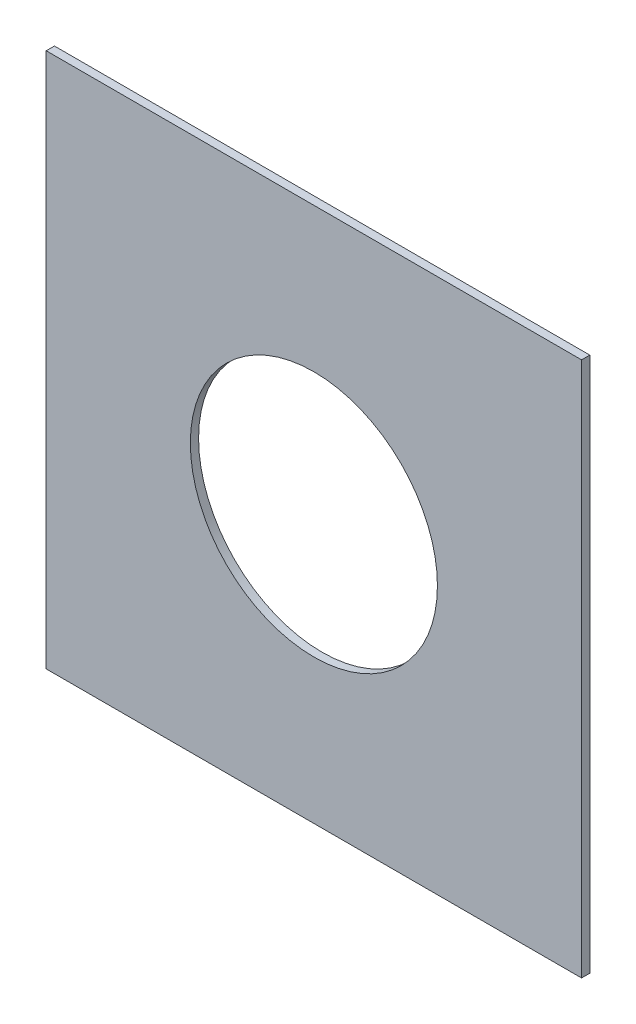
ISO-10303-21;
HEADER;
FILE_DESCRIPTION(('STEP AP214'),'2;1');
FILE_NAME('part.step','',(''),(''),'','','');
FILE_SCHEMA(('AUTOMOTIVE_DESIGN { 1 0 10303 214 1 1 1 1 }'));
ENDSEC;
DATA;
#1=APPLICATION_CONTEXT('core data for automotive mechanical design processes');
#2=APPLICATION_PROTOCOL_DEFINITION('international standard','automotive_design',2000,#1);
#3=PRODUCT_CONTEXT('',#1,'mechanical');
#4=PRODUCT('Part','Part','',(#3));
#5=PRODUCT_RELATED_PRODUCT_CATEGORY('part','',(#4));
#6=PRODUCT_DEFINITION_FORMATION('','',#4);
#7=PRODUCT_DEFINITION_CONTEXT('part definition',#1,'design');
#8=PRODUCT_DEFINITION('design','',#6,#7);
#9=PRODUCT_DEFINITION_SHAPE('','',#8);
#10=(LENGTH_UNIT() NAMED_UNIT(*) SI_UNIT(.MILLI.,.METRE.));
#11=(NAMED_UNIT(*) PLANE_ANGLE_UNIT() SI_UNIT($,.RADIAN.));
#12=(NAMED_UNIT(*) SI_UNIT($,.STERADIAN.) SOLID_ANGLE_UNIT());
#13=UNCERTAINTY_MEASURE_WITH_UNIT(LENGTH_MEASURE(1.E-05),#10,'distance_accuracy_value','');
#14=(GEOMETRIC_REPRESENTATION_CONTEXT(3) GLOBAL_UNCERTAINTY_ASSIGNED_CONTEXT((#13)) GLOBAL_UNIT_ASSIGNED_CONTEXT((#10,
#11,#12)) REPRESENTATION_CONTEXT('',''));
#15=CARTESIAN_POINT('',(0.,0.,0.));
#16=DIRECTION('',(0.,0.,1.));
#17=DIRECTION('',(1.,0.,0.));
#18=AXIS2_PLACEMENT_3D('',#15,#16,#17);
#19=CARTESIAN_POINT('',(-4.326,-3.55,-6.999));
#20=DIRECTION('',(0.,1.,0.));
#21=DIRECTION('',(1.,0.,0.));
#22=AXIS2_PLACEMENT_3D('',#19,#20,#21);
#23=PLANE('',#22);
#24=DIRECTION('',(0.,0.,1.));
#25=VECTOR('',#24,1.);
#26=CARTESIAN_POINT('',(-3.025,-3.55,-7.01));
#27=LINE('',#26,#25);
#28=CARTESIAN_POINT('',(-3.025,-3.55,-7.02));
#29=VERTEX_POINT('',#28);
#30=CARTESIAN_POINT('',(-3.025,-3.55,-7.));
#31=VERTEX_POINT('',#30);
#32=EDGE_CURVE('E62',#29,#31,#27,.T.);
#33=ORIENTED_EDGE('',*,*,#32,.F.);
#34=DIRECTION('',(1.,0.,0.));
#35=VECTOR('',#34,1.);
#36=CARTESIAN_POINT('',(-3.675,-3.55,-7.02));
#37=LINE('',#36,#35);
#38=CARTESIAN_POINT('',(-4.325,-3.55,-7.02));
#39=VERTEX_POINT('',#38);
#40=EDGE_CURVE('E87',#39,#29,#37,.T.);
#41=ORIENTED_EDGE('',*,*,#40,.F.);
#42=DIRECTION('',(0.,0.,-1.));
#43=VECTOR('',#42,1.);
#44=CARTESIAN_POINT('',(-4.325,-3.55,-7.01));
#45=LINE('',#44,#43);
#46=CARTESIAN_POINT('',(-4.325,-3.55,-7.));
#47=VERTEX_POINT('',#46);
#48=EDGE_CURVE('E73',#47,#39,#45,.T.);
#49=ORIENTED_EDGE('',*,*,#48,.F.);
#50=DIRECTION('',(-1.,0.,0.));
#51=VECTOR('',#50,1.);
#52=CARTESIAN_POINT('',(-3.675,-3.55,-7.));
#53=LINE('',#52,#51);
#54=EDGE_CURVE('E56',#31,#47,#53,.T.);
#55=ORIENTED_EDGE('',*,*,#54,.F.);
#56=EDGE_LOOP('',(#33,#41,#49,#55));
#57=FACE_BOUND('',#56,.T.);
#58=ADVANCED_FACE('F17',(#57),#23,.T.);
#59=CARTESIAN_POINT('',(-3.025,-3.549,-6.999));
#60=DIRECTION('',(1.,0.,0.));
#61=DIRECTION('',(0.,-1.,0.));
#62=AXIS2_PLACEMENT_3D('',#59,#60,#61);
#63=PLANE('',#62);
#64=DIRECTION('',(0.,0.,-1.));
#65=VECTOR('',#64,1.);
#66=CARTESIAN_POINT('',(-3.025,-4.85,-7.01));
#67=LINE('',#66,#65);
#68=CARTESIAN_POINT('',(-3.025,-4.85,-7.));
#69=VERTEX_POINT('',#68);
#70=CARTESIAN_POINT('',(-3.025,-4.85,-7.02));
#71=VERTEX_POINT('',#70);
#72=EDGE_CURVE('E71',#69,#71,#67,.T.);
#73=ORIENTED_EDGE('',*,*,#72,.T.);
#74=DIRECTION('',(0.,-1.,0.));
#75=VECTOR('',#74,1.);
#76=CARTESIAN_POINT('',(-3.025,-4.2,-7.02));
#77=LINE('',#76,#75);
#78=EDGE_CURVE('E67',#29,#71,#77,.T.);
#79=ORIENTED_EDGE('',*,*,#78,.F.);
#80=ORIENTED_EDGE('',*,*,#32,.T.);
#81=DIRECTION('',(0.,1.,0.));
#82=VECTOR('',#81,1.);
#83=CARTESIAN_POINT('',(-3.025,-4.2,-7.));
#84=LINE('',#83,#82);
#85=EDGE_CURVE('E64',#69,#31,#84,.T.);
#86=ORIENTED_EDGE('',*,*,#85,.F.);
#87=EDGE_LOOP('',(#73,#79,#80,#86));
#88=FACE_BOUND('',#87,.T.);
#89=ADVANCED_FACE('F63',(#88),#63,.T.);
#90=CARTESIAN_POINT('',(-3.675,-4.2,-7.));
#91=DIRECTION('',(0.,0.,-1.));
#92=DIRECTION('',(-1.,0.,0.));
#93=AXIS2_PLACEMENT_3D('',#90,#91,#92);
#94=CYLINDRICAL_SURFACE('',#93,0.3);
#95=CARTESIAN_POINT('',(-3.675,-4.2,-7.02));
#96=DIRECTION('',(0.,0.,-1.));
#97=DIRECTION('',(-1.,0.,0.));
#98=AXIS2_PLACEMENT_3D('',#95,#96,#97);
#99=CIRCLE('',#98,0.3);
#100=CARTESIAN_POINT('',(-3.975,-4.2,-7.02));
#101=VERTEX_POINT('',#100);
#102=EDGE_CURVE('E82',#101,#101,#99,.F.);
#103=ORIENTED_EDGE('',*,*,#102,.F.);
#104=EDGE_LOOP('',(#103));
#105=FACE_BOUND('',#104,.T.);
#106=CARTESIAN_POINT('',(-3.675,-4.2,-7.));
#107=DIRECTION('',(0.,0.,-1.));
#108=DIRECTION('',(-1.,0.,0.));
#109=AXIS2_PLACEMENT_3D('',#106,#107,#108);
#110=CIRCLE('',#109,0.3);
#111=CARTESIAN_POINT('',(-3.975,-4.2,-7.));
#112=VERTEX_POINT('',#111);
#113=EDGE_CURVE('E21',#112,#112,#110,.T.);
#114=ORIENTED_EDGE('',*,*,#113,.F.);
#115=EDGE_LOOP('',(#114));
#116=FACE_BOUND('',#115,.T.);
#117=ADVANCED_FACE('F99',(#105,#116),#94,.F.);
#118=CARTESIAN_POINT('',(-3.024,-3.549,-7.));
#119=DIRECTION('',(0.,0.,1.));
#120=DIRECTION('',(-1.,0.,0.));
#121=AXIS2_PLACEMENT_3D('',#118,#119,#120);
#122=PLANE('',#121);
#123=ORIENTED_EDGE('',*,*,#113,.T.);
#124=EDGE_LOOP('',(#123));
#125=FACE_BOUND('',#124,.T.);
#126=DIRECTION('',(0.,1.,0.));
#127=VECTOR('',#126,1.);
#128=CARTESIAN_POINT('',(-4.325,-4.2,-7.));
#129=LINE('',#128,#127);
#130=CARTESIAN_POINT('',(-4.325,-4.85,-7.));
#131=VERTEX_POINT('',#130);
#132=EDGE_CURVE('E94',#131,#47,#129,.T.);
#133=ORIENTED_EDGE('',*,*,#132,.F.);
#134=DIRECTION('',(-1.,0.,0.));
#135=VECTOR('',#134,1.);
#136=CARTESIAN_POINT('',(-3.675,-4.85,-7.));
#137=LINE('',#136,#135);
#138=EDGE_CURVE('E78',#69,#131,#137,.T.);
#139=ORIENTED_EDGE('',*,*,#138,.F.);
#140=ORIENTED_EDGE('',*,*,#85,.T.);
#141=ORIENTED_EDGE('',*,*,#54,.T.);
#142=EDGE_LOOP('',(#133,#139,#140,#141));
#143=FACE_BOUND('',#142,.T.);
#144=ADVANCED_FACE('F76',(#125,#143),#122,.T.);
#145=CARTESIAN_POINT('',(-4.325,-4.851,-6.999));
#146=DIRECTION('',(-1.,0.,0.));
#147=DIRECTION('',(0.,1.,0.));
#148=AXIS2_PLACEMENT_3D('',#145,#146,#147);
#149=PLANE('',#148);
#150=ORIENTED_EDGE('',*,*,#48,.T.);
#151=DIRECTION('',(0.,1.,0.));
#152=VECTOR('',#151,1.);
#153=CARTESIAN_POINT('',(-4.325,-4.2,-7.02));
#154=LINE('',#153,#152);
#155=CARTESIAN_POINT('',(-4.325,-4.85,-7.02));
#156=VERTEX_POINT('',#155);
#157=EDGE_CURVE('E36',#156,#39,#154,.T.);
#158=ORIENTED_EDGE('',*,*,#157,.F.);
#159=DIRECTION('',(0.,0.,-1.));
#160=VECTOR('',#159,1.);
#161=CARTESIAN_POINT('',(-4.325,-4.85,-7.01));
#162=LINE('',#161,#160);
#163=EDGE_CURVE('E27',#131,#156,#162,.T.);
#164=ORIENTED_EDGE('',*,*,#163,.F.);
#165=ORIENTED_EDGE('',*,*,#132,.T.);
#166=EDGE_LOOP('',(#150,#158,#164,#165));
#167=FACE_BOUND('',#166,.T.);
#168=ADVANCED_FACE('F108',(#167),#149,.T.);
#169=CARTESIAN_POINT('',(-4.326,-3.549,-7.02));
#170=DIRECTION('',(0.,0.,-1.));
#171=DIRECTION('',(1.,0.,0.));
#172=AXIS2_PLACEMENT_3D('',#169,#170,#171);
#173=PLANE('',#172);
#174=ORIENTED_EDGE('',*,*,#102,.T.);
#175=EDGE_LOOP('',(#174));
#176=FACE_BOUND('',#175,.T.);
#177=ORIENTED_EDGE('',*,*,#40,.T.);
#178=ORIENTED_EDGE('',*,*,#78,.T.);
#179=DIRECTION('',(1.,0.,0.));
#180=VECTOR('',#179,1.);
#181=CARTESIAN_POINT('',(-3.675,-4.85,-7.02));
#182=LINE('',#181,#180);
#183=EDGE_CURVE('E11',#156,#71,#182,.T.);
#184=ORIENTED_EDGE('',*,*,#183,.F.);
#185=ORIENTED_EDGE('',*,*,#157,.T.);
#186=EDGE_LOOP('',(#177,#178,#184,#185));
#187=FACE_BOUND('',#186,.T.);
#188=ADVANCED_FACE('F112',(#176,#187),#173,.T.);
#189=CARTESIAN_POINT('',(-3.024,-4.85,-6.999));
#190=DIRECTION('',(0.,-1.,0.));
#191=DIRECTION('',(-1.,0.,0.));
#192=AXIS2_PLACEMENT_3D('',#189,#190,#191);
#193=PLANE('',#192);
#194=ORIENTED_EDGE('',*,*,#163,.T.);
#195=ORIENTED_EDGE('',*,*,#183,.T.);
#196=ORIENTED_EDGE('',*,*,#72,.F.);
#197=ORIENTED_EDGE('',*,*,#138,.T.);
#198=EDGE_LOOP('',(#194,#195,#196,#197));
#199=FACE_BOUND('',#198,.T.);
#200=ADVANCED_FACE('F19',(#199),#193,.T.);
#201=CLOSED_SHELL('',(#58,#89,#117,#144,#168,#188,#200));
#202=MANIFOLD_SOLID_BREP('B1',#201);
#203=ADVANCED_BREP_SHAPE_REPRESENTATION('',(#18,#202),#14);
#204=SHAPE_DEFINITION_REPRESENTATION(#9,#203);
ENDSEC;
END-ISO-10303-21;
